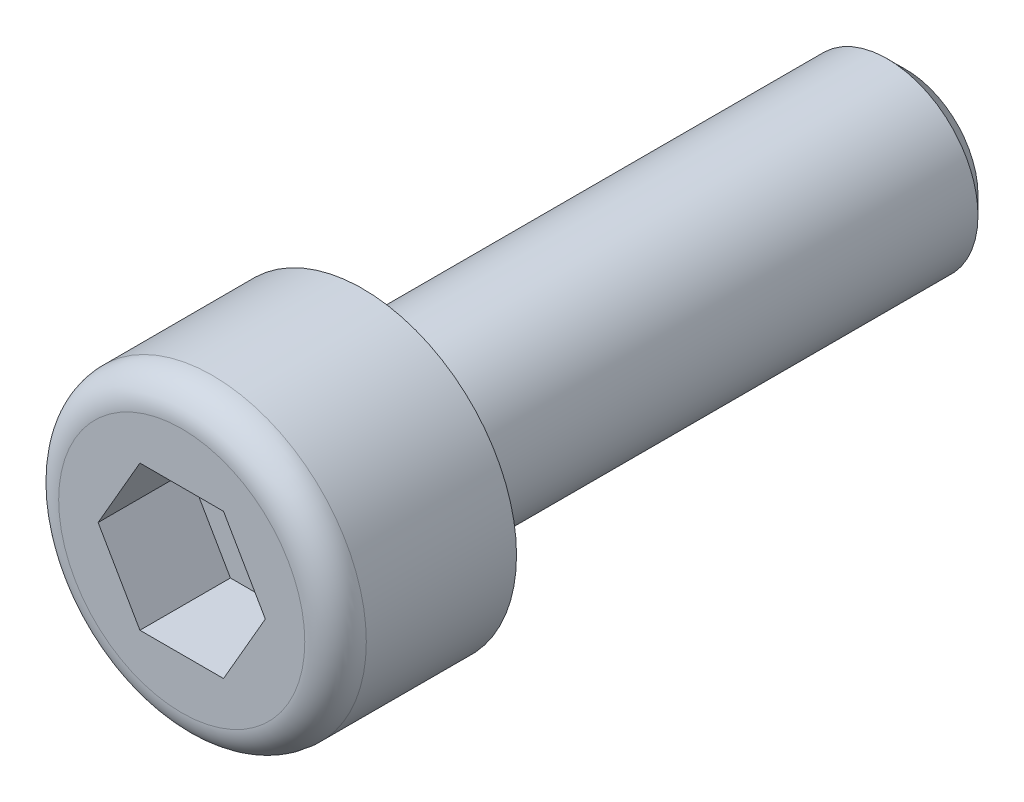
ISO-10303-21;
HEADER;
FILE_DESCRIPTION(('STEP AP214'),'2;1');
FILE_NAME('part.step','',(''),(''),'','','');
FILE_SCHEMA(('AUTOMOTIVE_DESIGN { 1 0 10303 214 1 1 1 1 }'));
ENDSEC;
DATA;
#1=APPLICATION_CONTEXT('core data for automotive mechanical design processes');
#2=APPLICATION_PROTOCOL_DEFINITION('international standard','automotive_design',2000,#1);
#3=PRODUCT_CONTEXT('',#1,'mechanical');
#4=PRODUCT('Part','Part','',(#3));
#5=PRODUCT_RELATED_PRODUCT_CATEGORY('part','',(#4));
#6=PRODUCT_DEFINITION_FORMATION('','',#4);
#7=PRODUCT_DEFINITION_CONTEXT('part definition',#1,'design');
#8=PRODUCT_DEFINITION('design','',#6,#7);
#9=PRODUCT_DEFINITION_SHAPE('','',#8);
#10=(LENGTH_UNIT() NAMED_UNIT(*) SI_UNIT(.MILLI.,.METRE.));
#11=(NAMED_UNIT(*) PLANE_ANGLE_UNIT() SI_UNIT($,.RADIAN.));
#12=(NAMED_UNIT(*) SI_UNIT($,.STERADIAN.) SOLID_ANGLE_UNIT());
#13=UNCERTAINTY_MEASURE_WITH_UNIT(LENGTH_MEASURE(1.E-05),#10,'distance_accuracy_value','');
#14=(GEOMETRIC_REPRESENTATION_CONTEXT(3) GLOBAL_UNCERTAINTY_ASSIGNED_CONTEXT((#13)) GLOBAL_UNIT_ASSIGNED_CONTEXT((#10,
#11,#12)) REPRESENTATION_CONTEXT('',''));
#15=CARTESIAN_POINT('',(0.,0.,0.));
#16=DIRECTION('',(0.,0.,1.));
#17=DIRECTION('',(1.,0.,0.));
#18=AXIS2_PLACEMENT_3D('',#15,#16,#17);
#19=CARTESIAN_POINT('',(0.,-2.001518682742,2.5));
#20=DIRECTION('',(0.,0.,1.));
#21=DIRECTION('',(1.,0.,0.));
#22=AXIS2_PLACEMENT_3D('',#19,#20,#21);
#23=PLANE('',#22);
#24=DIRECTION('',(-0.500000000000191,0.866025403784328,0.));
#25=VECTOR('',#24,1.);
#26=CARTESIAN_POINT('',(2.31,0.,2.5));
#27=LINE('',#26,#25);
#28=CARTESIAN_POINT('',(2.31,0.,2.5));
#29=VERTEX_POINT('',#28);
#30=CARTESIAN_POINT('',(1.155,2.000518682742,2.5));
#31=VERTEX_POINT('',#30);
#32=EDGE_CURVE('E12',#29,#31,#27,.T.);
#33=ORIENTED_EDGE('',*,*,#32,.T.);
#34=DIRECTION('',(-1.,0.,0.));
#35=VECTOR('',#34,1.);
#36=CARTESIAN_POINT('',(1.155,2.000518682742,2.5));
#37=LINE('',#36,#35);
#38=CARTESIAN_POINT('',(-1.155,2.000518682742,2.5));
#39=VERTEX_POINT('',#38);
#40=EDGE_CURVE('E52',#31,#39,#37,.T.);
#41=ORIENTED_EDGE('',*,*,#40,.T.);
#42=DIRECTION('',(-0.500000000000192,-0.866025403784328,0.));
#43=VECTOR('',#42,1.);
#44=CARTESIAN_POINT('',(-1.155,2.000518682742,2.5));
#45=LINE('',#44,#43);
#46=CARTESIAN_POINT('',(-2.31,0.,2.5));
#47=VERTEX_POINT('',#46);
#48=EDGE_CURVE('E150',#39,#47,#45,.T.);
#49=ORIENTED_EDGE('',*,*,#48,.T.);
#50=DIRECTION('',(0.500000000000191,-0.866025403784328,0.));
#51=VECTOR('',#50,1.);
#52=CARTESIAN_POINT('',(-2.31,0.,2.5));
#53=LINE('',#52,#51);
#54=CARTESIAN_POINT('',(-1.155,-2.000518682742,2.5));
#55=VERTEX_POINT('',#54);
#56=EDGE_CURVE('E135',#47,#55,#53,.T.);
#57=ORIENTED_EDGE('',*,*,#56,.T.);
#58=DIRECTION('',(1.,0.,0.));
#59=VECTOR('',#58,1.);
#60=CARTESIAN_POINT('',(-1.155,-2.000518682742,2.5));
#61=LINE('',#60,#59);
#62=CARTESIAN_POINT('',(1.155,-2.000518682742,2.5));
#63=VERTEX_POINT('',#62);
#64=EDGE_CURVE('E136',#55,#63,#61,.T.);
#65=ORIENTED_EDGE('',*,*,#64,.T.);
#66=DIRECTION('',(0.500000000000191,0.866025403784328,0.));
#67=VECTOR('',#66,1.);
#68=CARTESIAN_POINT('',(1.155,-2.000518682742,2.5));
#69=LINE('',#68,#67);
#70=EDGE_CURVE('E143',#63,#29,#69,.T.);
#71=ORIENTED_EDGE('',*,*,#70,.T.);
#72=EDGE_LOOP('',(#33,#41,#49,#57,#65,#71));
#73=FACE_BOUND('',#72,.T.);
#74=ADVANCED_FACE('F42',(#73),#23,.T.);
#75=CARTESIAN_POINT('',(1.73249999999979,1.00025934137088,5.001));
#76=DIRECTION('',(-0.866025403784328,-0.500000000000192,0.));
#77=DIRECTION('',(-0.500000000000192,0.866025403784328,0.));
#78=AXIS2_PLACEMENT_3D('',#75,#76,#77);
#79=PLANE('',#78);
#80=DIRECTION('',(0.,0.,1.));
#81=VECTOR('',#80,1.);
#82=CARTESIAN_POINT('',(2.31,0.,2.5));
#83=LINE('',#82,#81);
#84=CARTESIAN_POINT('',(2.31,0.,5.));
#85=VERTEX_POINT('',#84);
#86=EDGE_CURVE('E131',#29,#85,#83,.T.);
#87=ORIENTED_EDGE('',*,*,#86,.T.);
#88=DIRECTION('',(-0.500000000000191,0.866025403784328,0.));
#89=VECTOR('',#88,1.);
#90=CARTESIAN_POINT('',(2.31,0.,5.));
#91=LINE('',#90,#89);
#92=CARTESIAN_POINT('',(1.155,2.000518682742,5.));
#93=VERTEX_POINT('',#92);
#94=EDGE_CURVE('E132',#85,#93,#91,.T.);
#95=ORIENTED_EDGE('',*,*,#94,.T.);
#96=DIRECTION('',(0.,0.,1.));
#97=VECTOR('',#96,1.);
#98=CARTESIAN_POINT('',(1.155,2.000518682742,2.5));
#99=LINE('',#98,#97);
#100=EDGE_CURVE('E147',#31,#93,#99,.T.);
#101=ORIENTED_EDGE('',*,*,#100,.F.);
#102=ORIENTED_EDGE('',*,*,#32,.F.);
#103=EDGE_LOOP('',(#87,#95,#101,#102));
#104=FACE_BOUND('',#103,.T.);
#105=ADVANCED_FACE('F212',(#104),#79,.T.);
#106=CARTESIAN_POINT('',(0.,2.000518682742,5.001));
#107=DIRECTION('',(0.,-1.,0.));
#108=DIRECTION('',(0.,0.,-1.));
#109=AXIS2_PLACEMENT_3D('',#106,#107,#108);
#110=PLANE('',#109);
#111=ORIENTED_EDGE('',*,*,#100,.T.);
#112=DIRECTION('',(-1.,0.,0.));
#113=VECTOR('',#112,1.);
#114=CARTESIAN_POINT('',(1.155,2.000518682742,5.));
#115=LINE('',#114,#113);
#116=CARTESIAN_POINT('',(-1.155,2.000518682742,5.));
#117=VERTEX_POINT('',#116);
#118=EDGE_CURVE('E153',#93,#117,#115,.T.);
#119=ORIENTED_EDGE('',*,*,#118,.T.);
#120=DIRECTION('',(0.,0.,1.));
#121=VECTOR('',#120,1.);
#122=CARTESIAN_POINT('',(-1.155,2.000518682742,2.5));
#123=LINE('',#122,#121);
#124=EDGE_CURVE('E138',#39,#117,#123,.T.);
#125=ORIENTED_EDGE('',*,*,#124,.F.);
#126=ORIENTED_EDGE('',*,*,#40,.F.);
#127=EDGE_LOOP('',(#111,#119,#125,#126));
#128=FACE_BOUND('',#127,.T.);
#129=ADVANCED_FACE('F215',(#128),#110,.T.);
#130=CARTESIAN_POINT('',(-1.73250000000021,1.00025934137112,5.001));
#131=DIRECTION('',(0.866025403784328,-0.500000000000192,0.));
#132=DIRECTION('',(0.,0.,-1.));
#133=AXIS2_PLACEMENT_3D('',#130,#131,#132);
#134=PLANE('',#133);
#135=ORIENTED_EDGE('',*,*,#124,.T.);
#136=DIRECTION('',(-0.500000000000192,-0.866025403784328,0.));
#137=VECTOR('',#136,1.);
#138=CARTESIAN_POINT('',(-1.155,2.000518682742,5.));
#139=LINE('',#138,#137);
#140=CARTESIAN_POINT('',(-2.31,0.,5.));
#141=VERTEX_POINT('',#140);
#142=EDGE_CURVE('E165',#117,#141,#139,.T.);
#143=ORIENTED_EDGE('',*,*,#142,.T.);
#144=DIRECTION('',(0.,0.,1.));
#145=VECTOR('',#144,1.);
#146=CARTESIAN_POINT('',(-2.31,0.,2.5));
#147=LINE('',#146,#145);
#148=EDGE_CURVE('E133',#47,#141,#147,.T.);
#149=ORIENTED_EDGE('',*,*,#148,.F.);
#150=ORIENTED_EDGE('',*,*,#48,.F.);
#151=EDGE_LOOP('',(#135,#143,#149,#150));
#152=FACE_BOUND('',#151,.T.);
#153=ADVANCED_FACE('F194',(#152),#134,.T.);
#154=CARTESIAN_POINT('',(-1.73249999999979,-1.00025934137088,5.001));
#155=DIRECTION('',(0.866025403784328,0.500000000000192,0.));
#156=DIRECTION('',(0.,0.,-1.));
#157=AXIS2_PLACEMENT_3D('',#154,#155,#156);
#158=PLANE('',#157);
#159=ORIENTED_EDGE('',*,*,#148,.T.);
#160=DIRECTION('',(0.500000000000191,-0.866025403784328,0.));
#161=VECTOR('',#160,1.);
#162=CARTESIAN_POINT('',(-2.31,0.,5.));
#163=LINE('',#162,#161);
#164=CARTESIAN_POINT('',(-1.155,-2.000518682742,5.));
#165=VERTEX_POINT('',#164);
#166=EDGE_CURVE('E168',#141,#165,#163,.T.);
#167=ORIENTED_EDGE('',*,*,#166,.T.);
#168=DIRECTION('',(0.,0.,1.));
#169=VECTOR('',#168,1.);
#170=CARTESIAN_POINT('',(-1.155,-2.000518682742,2.5));
#171=LINE('',#170,#169);
#172=EDGE_CURVE('E163',#55,#165,#171,.T.);
#173=ORIENTED_EDGE('',*,*,#172,.F.);
#174=ORIENTED_EDGE('',*,*,#56,.F.);
#175=EDGE_LOOP('',(#159,#167,#173,#174));
#176=FACE_BOUND('',#175,.T.);
#177=ADVANCED_FACE('F193',(#176),#158,.T.);
#178=CARTESIAN_POINT('',(0.,-2.000518682742,5.001));
#179=DIRECTION('',(0.,1.,0.));
#180=DIRECTION('',(1.,0.,0.));
#181=AXIS2_PLACEMENT_3D('',#178,#179,#180);
#182=PLANE('',#181);
#183=ORIENTED_EDGE('',*,*,#172,.T.);
#184=DIRECTION('',(1.,0.,0.));
#185=VECTOR('',#184,1.);
#186=CARTESIAN_POINT('',(-1.155,-2.000518682742,5.));
#187=LINE('',#186,#185);
#188=CARTESIAN_POINT('',(1.155,-2.000518682742,5.));
#189=VERTEX_POINT('',#188);
#190=EDGE_CURVE('E157',#165,#189,#187,.T.);
#191=ORIENTED_EDGE('',*,*,#190,.T.);
#192=DIRECTION('',(0.,0.,1.));
#193=VECTOR('',#192,1.);
#194=CARTESIAN_POINT('',(1.155,-2.000518682742,2.5));
#195=LINE('',#194,#193);
#196=EDGE_CURVE('E129',#63,#189,#195,.T.);
#197=ORIENTED_EDGE('',*,*,#196,.F.);
#198=ORIENTED_EDGE('',*,*,#64,.F.);
#199=EDGE_LOOP('',(#183,#191,#197,#198));
#200=FACE_BOUND('',#199,.T.);
#201=ADVANCED_FACE('F206',(#200),#182,.T.);
#202=CARTESIAN_POINT('',(1.73250000000021,-1.00025934137112,5.001));
#203=DIRECTION('',(-0.866025403784328,0.500000000000192,0.));
#204=DIRECTION('',(0.,0.,1.));
#205=AXIS2_PLACEMENT_3D('',#202,#203,#204);
#206=PLANE('',#205);
#207=ORIENTED_EDGE('',*,*,#196,.T.);
#208=DIRECTION('',(0.500000000000191,0.866025403784328,0.));
#209=VECTOR('',#208,1.);
#210=CARTESIAN_POINT('',(1.155,-2.000518682742,5.));
#211=LINE('',#210,#209);
#212=EDGE_CURVE('E154',#189,#85,#211,.T.);
#213=ORIENTED_EDGE('',*,*,#212,.T.);
#214=ORIENTED_EDGE('',*,*,#86,.F.);
#215=ORIENTED_EDGE('',*,*,#70,.F.);
#216=EDGE_LOOP('',(#207,#213,#214,#215));
#217=FACE_BOUND('',#216,.T.);
#218=ADVANCED_FACE('F210',(#217),#206,.T.);
#219=CARTESIAN_POINT('',(0.,-3.401,5.));
#220=DIRECTION('',(0.,0.,1.));
#221=DIRECTION('',(1.,0.,0.));
#222=AXIS2_PLACEMENT_3D('',#219,#220,#221);
#223=PLANE('',#222);
#224=ORIENTED_EDGE('',*,*,#212,.F.);
#225=ORIENTED_EDGE('',*,*,#190,.F.);
#226=ORIENTED_EDGE('',*,*,#166,.F.);
#227=ORIENTED_EDGE('',*,*,#142,.F.);
#228=ORIENTED_EDGE('',*,*,#118,.F.);
#229=ORIENTED_EDGE('',*,*,#94,.F.);
#230=EDGE_LOOP('',(#224,#225,#226,#227,#228,#229));
#231=FACE_BOUND('',#230,.T.);
#232=CARTESIAN_POINT('',(0.,0.,5.));
#233=DIRECTION('',(0.,0.,1.));
#234=DIRECTION('',(-1.,0.,0.));
#235=AXIS2_PLACEMENT_3D('',#232,#233,#234);
#236=CIRCLE('',#235,3.4);
#237=CARTESIAN_POINT('',(-3.4,0.,5.));
#238=VERTEX_POINT('',#237);
#239=EDGE_CURVE('E160',#238,#238,#236,.T.);
#240=ORIENTED_EDGE('',*,*,#239,.T.);
#241=EDGE_LOOP('',(#240));
#242=FACE_BOUND('',#241,.T.);
#243=ADVANCED_FACE('F201',(#231,#242),#223,.T.);
#244=CARTESIAN_POINT('',(0.,0.,4.15));
#245=DIRECTION('',(0.,0.,1.));
#246=DIRECTION('',(1.,0.,0.));
#247=AXIS2_PLACEMENT_3D('',#244,#245,#246);
#248=TOROIDAL_SURFACE('',#247,3.4,0.85);
#249=ORIENTED_EDGE('',*,*,#239,.F.);
#250=CARTESIAN_POINT('',(-3.4,0.,4.15));
#251=DIRECTION('',(0.,-1.,0.));
#252=DIRECTION('',(-1.,0.,0.));
#253=AXIS2_PLACEMENT_3D('',#250,#251,#252);
#254=CIRCLE('',#253,0.85);
#255=CARTESIAN_POINT('',(-4.25,0.,4.15));
#256=VERTEX_POINT('',#255);
#257=EDGE_CURVE('E158',#238,#256,#254,.T.);
#258=ORIENTED_EDGE('',*,*,#257,.T.);
#259=CARTESIAN_POINT('',(0.,0.,4.15));
#260=DIRECTION('',(0.,0.,1.));
#261=DIRECTION('',(-1.,0.,0.));
#262=AXIS2_PLACEMENT_3D('',#259,#260,#261);
#263=CIRCLE('',#262,4.25);
#264=CARTESIAN_POINT('',(4.25,0.,4.15));
#265=VERTEX_POINT('',#264);
#266=EDGE_CURVE('E146',#256,#265,#263,.T.);
#267=ORIENTED_EDGE('',*,*,#266,.T.);
#268=CARTESIAN_POINT('',(0.,0.,4.15));
#269=DIRECTION('',(0.,0.,1.));
#270=DIRECTION('',(-1.,0.,0.));
#271=AXIS2_PLACEMENT_3D('',#268,#269,#270);
#272=CIRCLE('',#271,4.25);
#273=EDGE_CURVE('E141',#265,#256,#272,.T.);
#274=ORIENTED_EDGE('',*,*,#273,.T.);
#275=ORIENTED_EDGE('',*,*,#257,.F.);
#276=EDGE_LOOP('',(#249,#258,#267,#274,#275));
#277=FACE_BOUND('',#276,.T.);
#278=ADVANCED_FACE('F233',(#277),#248,.T.);
#279=CARTESIAN_POINT('',(0.,0.,2.075));
#280=DIRECTION('',(0.,0.,1.));
#281=DIRECTION('',(-1.,0.,0.));
#282=AXIS2_PLACEMENT_3D('',#279,#280,#281);
#283=CYLINDRICAL_SURFACE('',#282,4.25);
#284=ORIENTED_EDGE('',*,*,#273,.F.);
#285=DIRECTION('',(0.,0.,-1.));
#286=VECTOR('',#285,1.);
#287=CARTESIAN_POINT('',(4.25,0.,2.075));
#288=LINE('',#287,#286);
#289=CARTESIAN_POINT('',(4.25,0.,0.));
#290=VERTEX_POINT('',#289);
#291=EDGE_CURVE('E144',#265,#290,#288,.T.);
#292=ORIENTED_EDGE('',*,*,#291,.T.);
#293=CARTESIAN_POINT('',(0.,0.,0.));
#294=DIRECTION('',(0.,0.,1.));
#295=DIRECTION('',(-1.,0.,0.));
#296=AXIS2_PLACEMENT_3D('',#293,#294,#295);
#297=CIRCLE('',#296,4.25);
#298=EDGE_CURVE('E122',#290,#290,#297,.T.);
#299=ORIENTED_EDGE('',*,*,#298,.T.);
#300=ORIENTED_EDGE('',*,*,#291,.F.);
#301=ORIENTED_EDGE('',*,*,#266,.F.);
#302=EDGE_LOOP('',(#284,#292,#299,#300,#301));
#303=FACE_BOUND('',#302,.T.);
#304=ADVANCED_FACE('F239',(#303),#283,.T.);
#305=CARTESIAN_POINT('',(0.,-4.251,0.));
#306=DIRECTION('',(0.,0.,-1.));
#307=DIRECTION('',(0.,-1.,0.));
#308=AXIS2_PLACEMENT_3D('',#305,#306,#307);
#309=PLANE('',#308);
#310=CARTESIAN_POINT('',(0.,0.,0.));
#311=DIRECTION('',(0.,0.,1.));
#312=DIRECTION('',(-1.,0.,0.));
#313=AXIS2_PLACEMENT_3D('',#310,#311,#312);
#314=CIRCLE('',#313,2.5);
#315=CARTESIAN_POINT('',(2.5,0.,0.));
#316=VERTEX_POINT('',#315);
#317=EDGE_CURVE('E121',#316,#316,#314,.T.);
#318=ORIENTED_EDGE('',*,*,#317,.T.);
#319=EDGE_LOOP('',(#318));
#320=FACE_BOUND('',#319,.T.);
#321=ORIENTED_EDGE('',*,*,#298,.F.);
#322=EDGE_LOOP('',(#321));
#323=FACE_BOUND('',#322,.T.);
#324=ADVANCED_FACE('F237',(#320,#323),#309,.T.);
#325=CARTESIAN_POINT('',(0.,0.,-9.75));
#326=DIRECTION('',(0.,0.,1.));
#327=DIRECTION('',(-1.,0.,0.));
#328=AXIS2_PLACEMENT_3D('',#325,#326,#327);
#329=CYLINDRICAL_SURFACE('',#328,2.5);
#330=ORIENTED_EDGE('',*,*,#317,.F.);
#331=DIRECTION('',(0.,0.,-1.));
#332=VECTOR('',#331,1.);
#333=CARTESIAN_POINT('',(2.5,0.,-9.75));
#334=LINE('',#333,#332);
#335=CARTESIAN_POINT('',(2.5,0.,-14.4999999999998));
#336=VERTEX_POINT('',#335);
#337=EDGE_CURVE('E116',#316,#336,#334,.T.);
#338=ORIENTED_EDGE('',*,*,#337,.T.);
#339=CARTESIAN_POINT('',(0.,0.,-14.5));
#340=DIRECTION('',(0.,0.,1.));
#341=DIRECTION('',(-1.,0.,0.));
#342=AXIS2_PLACEMENT_3D('',#339,#340,#341);
#343=CIRCLE('',#342,2.5);
#344=CARTESIAN_POINT('',(2.03456509012751,1.45277145278718,-14.5));
#345=VERTEX_POINT('',#344);
#346=EDGE_CURVE('E119',#336,#345,#343,.T.);
#347=ORIENTED_EDGE('',*,*,#346,.T.);
#348=CARTESIAN_POINT('',(0.,0.,-14.5));
#349=DIRECTION('',(0.,0.,1.));
#350=DIRECTION('',(-1.,0.,0.));
#351=AXIS2_PLACEMENT_3D('',#348,#349,#350);
#352=CIRCLE('',#351,2.5);
#353=EDGE_CURVE('E46',#345,#336,#352,.T.);
#354=ORIENTED_EDGE('',*,*,#353,.T.);
#355=ORIENTED_EDGE('',*,*,#337,.F.);
#356=EDGE_LOOP('',(#330,#338,#347,#354,#355));
#357=FACE_BOUND('',#356,.T.);
#358=ADVANCED_FACE('F118',(#357),#329,.T.);
#359=CARTESIAN_POINT('',(0.,0.,-14.55));
#360=DIRECTION('',(0.,0.,1.));
#361=DIRECTION('',(-0.813826036051075,-0.58110858111492,0.));
#362=AXIS2_PLACEMENT_3D('',#359,#360,#361);
#363=CONICAL_SURFACE('',#362,2.4499999999998,0.785398163397029);
#364=ORIENTED_EDGE('',*,*,#346,.F.);
#365=ORIENTED_EDGE('',*,*,#353,.F.);
#366=DIRECTION('',(-0.575461908797641,-0.41090581831188,-0.707106781186844));
#367=VECTOR('',#366,1.);
#368=CARTESIAN_POINT('',(1.99387378832497,1.42371602373144,-14.55));
#369=LINE('',#368,#367);
#370=CARTESIAN_POINT('',(1.62765207210214,1.16221716222984,-15.));
#371=VERTEX_POINT('',#370);
#372=EDGE_CURVE('E110',#345,#371,#369,.T.);
#373=ORIENTED_EDGE('',*,*,#372,.T.);
#374=CARTESIAN_POINT('',(0.,0.,-15.));
#375=DIRECTION('',(0.,0.,1.));
#376=DIRECTION('',(-1.,0.,0.));
#377=AXIS2_PLACEMENT_3D('',#374,#375,#376);
#378=CIRCLE('',#377,2.);
#379=EDGE_CURVE('E125',#371,#371,#378,.T.);
#380=ORIENTED_EDGE('',*,*,#379,.T.);
#381=ORIENTED_EDGE('',*,*,#372,.F.);
#382=EDGE_LOOP('',(#364,#365,#373,#380,#381));
#383=FACE_BOUND('',#382,.T.);
#384=ADVANCED_FACE('F124',(#383),#363,.T.);
#385=CARTESIAN_POINT('',(0.,-2.001,-15.));
#386=DIRECTION('',(0.,0.,-1.));
#387=DIRECTION('',(0.,-1.,0.));
#388=AXIS2_PLACEMENT_3D('',#385,#386,#387);
#389=PLANE('',#388);
#390=ORIENTED_EDGE('',*,*,#379,.F.);
#391=EDGE_LOOP('',(#390));
#392=FACE_BOUND('',#391,.T.);
#393=ADVANCED_FACE('F44',(#392),#389,.T.);
#394=CLOSED_SHELL('',(#74,#105,#129,#153,#177,#201,#218,#243,#278,#304,#324,#358,#384,#393));
#395=MANIFOLD_SOLID_BREP('B2',#394);
#396=ADVANCED_BREP_SHAPE_REPRESENTATION('',(#18,#395),#14);
#397=SHAPE_DEFINITION_REPRESENTATION(#9,#396);
ENDSEC;
END-ISO-10303-21;
